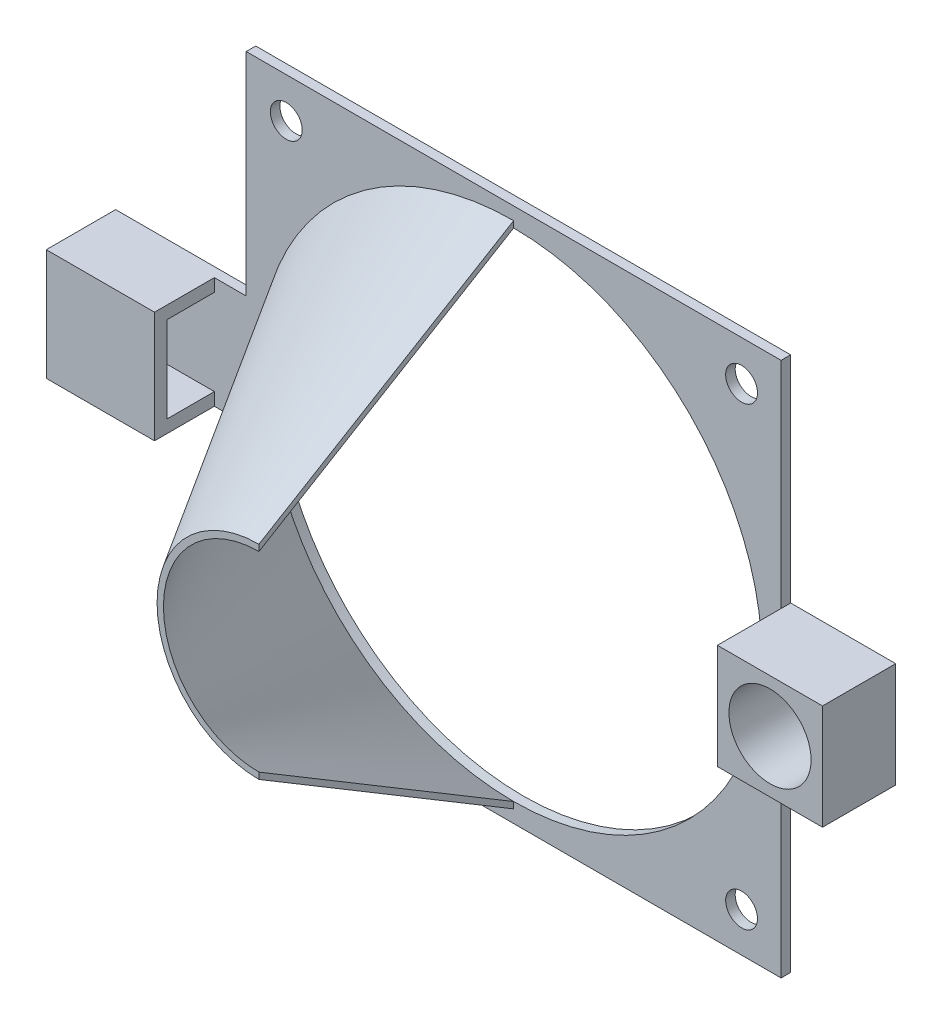
ISO-10303-21;
HEADER;
FILE_DESCRIPTION(('STEP AP214'),'2;1');
FILE_NAME('part.step','',(''),(''),'','','');
FILE_SCHEMA(('AUTOMOTIVE_DESIGN { 1 0 10303 214 1 1 1 1 }'));
ENDSEC;
DATA;
#1=APPLICATION_CONTEXT('core data for automotive mechanical design processes');
#2=APPLICATION_PROTOCOL_DEFINITION('international standard','automotive_design',2000,#1);
#3=PRODUCT_CONTEXT('',#1,'mechanical');
#4=PRODUCT('Part','Part','',(#3));
#5=PRODUCT_RELATED_PRODUCT_CATEGORY('part','',(#4));
#6=PRODUCT_DEFINITION_FORMATION('','',#4);
#7=PRODUCT_DEFINITION_CONTEXT('part definition',#1,'design');
#8=PRODUCT_DEFINITION('design','',#6,#7);
#9=PRODUCT_DEFINITION_SHAPE('','',#8);
#10=(LENGTH_UNIT() NAMED_UNIT(*) SI_UNIT(.MILLI.,.METRE.));
#11=(NAMED_UNIT(*) PLANE_ANGLE_UNIT() SI_UNIT($,.RADIAN.));
#12=(NAMED_UNIT(*) SI_UNIT($,.STERADIAN.) SOLID_ANGLE_UNIT());
#13=UNCERTAINTY_MEASURE_WITH_UNIT(LENGTH_MEASURE(1.E-05),#10,'distance_accuracy_value','');
#14=(GEOMETRIC_REPRESENTATION_CONTEXT(3) GLOBAL_UNCERTAINTY_ASSIGNED_CONTEXT((#13)) GLOBAL_UNIT_ASSIGNED_CONTEXT((#10,
#11,#12)) REPRESENTATION_CONTEXT('',''));
#15=CARTESIAN_POINT('',(0.,0.,0.));
#16=DIRECTION('',(0.,0.,1.));
#17=DIRECTION('',(1.,0.,0.));
#18=AXIS2_PLACEMENT_3D('',#15,#16,#17);
#19=CARTESIAN_POINT('',(-19.3198380566802,34.4939271255061,1.5));
#20=DIRECTION('',(-1.,0.,0.));
#21=DIRECTION('',(0.,-1.,0.));
#22=AXIS2_PLACEMENT_3D('',#19,#20,#21);
#23=PLANE('',#22);
#24=DIRECTION('',(0.,0.,-1.));
#25=VECTOR('',#24,1.);
#26=CARTESIAN_POINT('',(-19.3198380566801,-15.7560728744939,1.5));
#27=LINE('',#26,#25);
#28=CARTESIAN_POINT('',(-19.3198380566801,-15.7560728744939,1.5));
#29=VERTEX_POINT('',#28);
#30=CARTESIAN_POINT('',(-19.3198380566801,-15.7560728744939,0.));
#31=VERTEX_POINT('',#30);
#32=EDGE_CURVE('E226',#29,#31,#27,.T.);
#33=ORIENTED_EDGE('',*,*,#32,.F.);
#34=DIRECTION('',(0.,1.,0.));
#35=VECTOR('',#34,1.);
#36=CARTESIAN_POINT('',(-19.3198380566802,34.4939271255061,1.5));
#37=LINE('',#36,#35);
#38=CARTESIAN_POINT('',(-19.3198380566801,-49.5060728744939,1.5));
#39=VERTEX_POINT('',#38);
#40=EDGE_CURVE('E445',#39,#29,#37,.T.);
#41=ORIENTED_EDGE('',*,*,#40,.F.);
#42=DIRECTION('',(0.,0.,-1.));
#43=VECTOR('',#42,1.);
#44=CARTESIAN_POINT('',(-19.3198380566801,-49.5060728744939,1.5));
#45=LINE('',#44,#43);
#46=CARTESIAN_POINT('',(-19.3198380566801,-49.5060728744939,0.));
#47=VERTEX_POINT('',#46);
#48=EDGE_CURVE('E359',#39,#47,#45,.T.);
#49=ORIENTED_EDGE('',*,*,#48,.T.);
#50=DIRECTION('',(0.,1.,0.));
#51=VECTOR('',#50,1.);
#52=CARTESIAN_POINT('',(-19.3198380566802,34.4939271255061,0.));
#53=LINE('',#52,#51);
#54=EDGE_CURVE('E60',#47,#31,#53,.T.);
#55=ORIENTED_EDGE('',*,*,#54,.T.);
#56=EDGE_LOOP('',(#33,#41,#49,#55));
#57=FACE_BOUND('',#56,.T.);
#58=ADVANCED_FACE('F35',(#57),#23,.F.);
#59=DIRECTION('',(0.,0.,1.));
#60=VECTOR('',#59,1.);
#61=CARTESIAN_POINT('',(-19.3198380566801,0.743927125506059,0.));
#62=LINE('',#61,#60);
#63=CARTESIAN_POINT('',(-19.3198380566801,0.74392712550609,0.));
#64=VERTEX_POINT('',#63);
#65=CARTESIAN_POINT('',(-19.3198380566801,0.743927125506055,1.5));
#66=VERTEX_POINT('',#65);
#67=EDGE_CURVE('E52',#64,#66,#62,.T.);
#68=ORIENTED_EDGE('',*,*,#67,.F.);
#69=CARTESIAN_POINT('',(-19.3198380566802,34.4939271255061,0.));
#70=VERTEX_POINT('',#69);
#71=EDGE_CURVE('E343',#64,#70,#53,.T.);
#72=ORIENTED_EDGE('',*,*,#71,.T.);
#73=DIRECTION('',(0.,0.,-1.));
#74=VECTOR('',#73,1.);
#75=CARTESIAN_POINT('',(-19.3198380566802,34.4939271255061,1.5));
#76=LINE('',#75,#74);
#77=CARTESIAN_POINT('',(-19.3198380566802,34.4939271255061,1.5));
#78=VERTEX_POINT('',#77);
#79=EDGE_CURVE('E355',#78,#70,#76,.T.);
#80=ORIENTED_EDGE('',*,*,#79,.F.);
#81=EDGE_CURVE('E449',#66,#78,#37,.T.);
#82=ORIENTED_EDGE('',*,*,#81,.F.);
#83=EDGE_LOOP('',(#68,#72,#80,#82));
#84=FACE_BOUND('',#83,.T.);
#85=ADVANCED_FACE('F494',(#84),#23,.F.);
#86=CARTESIAN_POINT('',(-123.31983805668,0.,0.));
#87=DIRECTION('',(-1.,0.,0.));
#88=DIRECTION('',(0.,0.,1.));
#89=AXIS2_PLACEMENT_3D('',#86,#87,#88);
#90=PLANE('',#89);
#91=DIRECTION('',(0.,-1.,0.));
#92=VECTOR('',#91,1.);
#93=CARTESIAN_POINT('',(-123.31983805668,0.,8.9));
#94=LINE('',#93,#92);
#95=CARTESIAN_POINT('',(-123.31983805668,-6.47772468443378,8.9));
#96=VERTEX_POINT('',#95);
#97=CARTESIAN_POINT('',(-123.31983805668,-8.53442106455411,8.9));
#98=VERTEX_POINT('',#97);
#99=EDGE_CURVE('E295',#96,#98,#94,.T.);
#100=ORIENTED_EDGE('',*,*,#99,.T.);
#101=CARTESIAN_POINT('',(-123.31983805668,-7.50607287449394,5.45));
#102=DIRECTION('',(-1.,0.,0.));
#103=DIRECTION('',(0.,0.,1.));
#104=AXIS2_PLACEMENT_3D('',#101,#102,#103);
#105=CIRCLE('',#104,3.6);
#106=EDGE_CURVE('E44',#98,#96,#105,.T.);
#107=ORIENTED_EDGE('',*,*,#106,.T.);
#108=EDGE_LOOP('',(#100,#107));
#109=FACE_BOUND('',#108,.T.);
#110=ADVANCED_FACE('F499',(#109),#90,.T.);
#111=CARTESIAN_POINT('',(0.,0.,1.5));
#112=DIRECTION('',(0.,0.,1.));
#113=DIRECTION('',(1.,0.,0.));
#114=AXIS2_PLACEMENT_3D('',#111,#112,#113);
#115=PLANE('',#114);
#116=ORIENTED_EDGE('',*,*,#40,.T.);
#117=DIRECTION('',(0.,-1.,0.));
#118=VECTOR('',#117,1.);
#119=CARTESIAN_POINT('',(-19.3198380566801,-15.7560728744939,1.5));
#120=LINE('',#119,#118);
#121=EDGE_CURVE('E221',#66,#29,#120,.T.);
#122=ORIENTED_EDGE('',*,*,#121,.F.);
#123=ORIENTED_EDGE('',*,*,#81,.T.);
#124=DIRECTION('',(-1.,0.,0.));
#125=VECTOR('',#124,1.);
#126=CARTESIAN_POINT('',(-103.31983805668,34.4939271255061,1.5));
#127=LINE('',#126,#125);
#128=CARTESIAN_POINT('',(-103.31983805668,34.4939271255061,1.5));
#129=VERTEX_POINT('',#128);
#130=EDGE_CURVE('E356',#78,#129,#127,.T.);
#131=ORIENTED_EDGE('',*,*,#130,.T.);
#132=DIRECTION('',(0.,-1.,0.));
#133=VECTOR('',#132,1.);
#134=CARTESIAN_POINT('',(-103.31983805668,34.4939271255061,1.5));
#135=LINE('',#134,#133);
#136=CARTESIAN_POINT('',(-103.31983805668,1.2439271255061,1.5));
#137=VERTEX_POINT('',#136);
#138=EDGE_CURVE('E436',#129,#137,#135,.T.);
#139=ORIENTED_EDGE('',*,*,#138,.T.);
#140=DIRECTION('',(1.,0.,0.));
#141=VECTOR('',#140,1.);
#142=CARTESIAN_POINT('',(-123.31983805668,1.24392712550606,1.5));
#143=LINE('',#142,#141);
#144=CARTESIAN_POINT('',(-108.31983805668,1.24392712550606,1.5));
#145=VERTEX_POINT('',#144);
#146=EDGE_CURVE('E338',#145,#137,#143,.T.);
#147=ORIENTED_EDGE('',*,*,#146,.F.);
#148=DIRECTION('',(0.,1.,0.));
#149=VECTOR('',#148,1.);
#150=CARTESIAN_POINT('',(-108.31983805668,0.,1.5));
#151=LINE('',#150,#149);
#152=CARTESIAN_POINT('',(-108.31983805668,-0.756072874493947,1.5));
#153=VERTEX_POINT('',#152);
#154=EDGE_CURVE('E283',#153,#145,#151,.T.);
#155=ORIENTED_EDGE('',*,*,#154,.F.);
#156=DIRECTION('',(-1.,0.,0.));
#157=VECTOR('',#156,1.);
#158=CARTESIAN_POINT('',(-108.31983805668,-0.756072874493947,1.5));
#159=LINE('',#158,#157);
#160=CARTESIAN_POINT('',(-123.31983805668,-0.756072874493947,1.5));
#161=VERTEX_POINT('',#160);
#162=EDGE_CURVE('E298',#153,#161,#159,.T.);
#163=ORIENTED_EDGE('',*,*,#162,.T.);
#164=DIRECTION('',(0.,1.,0.));
#165=VECTOR('',#164,1.);
#166=CARTESIAN_POINT('',(-123.31983805668,-16.2560728744939,1.5));
#167=LINE('',#166,#165);
#168=CARTESIAN_POINT('',(-123.31983805668,-14.2560728744939,1.5));
#169=VERTEX_POINT('',#168);
#170=EDGE_CURVE('E315',#169,#161,#167,.T.);
#171=ORIENTED_EDGE('',*,*,#170,.F.);
#172=DIRECTION('',(-1.,0.,0.));
#173=VECTOR('',#172,1.);
#174=CARTESIAN_POINT('',(-108.31983805668,-14.2560728744939,1.5));
#175=LINE('',#174,#173);
#176=CARTESIAN_POINT('',(-108.31983805668,-14.2560728744939,1.5));
#177=VERTEX_POINT('',#176);
#178=EDGE_CURVE('E306',#177,#169,#175,.T.);
#179=ORIENTED_EDGE('',*,*,#178,.F.);
#180=CARTESIAN_POINT('',(-108.31983805668,-16.2560728744939,1.5));
#181=VERTEX_POINT('',#180);
#182=EDGE_CURVE('E280',#181,#177,#151,.T.);
#183=ORIENTED_EDGE('',*,*,#182,.F.);
#184=DIRECTION('',(1.,0.,0.));
#185=VECTOR('',#184,1.);
#186=CARTESIAN_POINT('',(-123.31983805668,-16.2560728744939,1.5));
#187=LINE('',#186,#185);
#188=CARTESIAN_POINT('',(-103.31983805668,-16.2560728744939,1.5));
#189=VERTEX_POINT('',#188);
#190=EDGE_CURVE('E335',#181,#189,#187,.T.);
#191=ORIENTED_EDGE('',*,*,#190,.T.);
#192=CARTESIAN_POINT('',(-103.31983805668,-49.5060728744939,1.5));
#193=VERTEX_POINT('',#192);
#194=EDGE_CURVE('E327',#189,#193,#135,.T.);
#195=ORIENTED_EDGE('',*,*,#194,.T.);
#196=DIRECTION('',(1.,0.,0.));
#197=VECTOR('',#196,1.);
#198=CARTESIAN_POINT('',(-103.31983805668,-49.5060728744939,1.5));
#199=LINE('',#198,#197);
#200=EDGE_CURVE('E433',#193,#39,#199,.T.);
#201=ORIENTED_EDGE('',*,*,#200,.T.);
#202=EDGE_LOOP('',(#116,#122,#123,#131,#139,#147,#155,#163,#171,#179,#183,#191,#195,#201));
#203=FACE_BOUND('',#202,.T.);
#204=CARTESIAN_POINT('',(-25.5287305066001,-43.2971804245733,1.5));
#205=DIRECTION('',(0.,0.,1.));
#206=DIRECTION('',(1.,0.,0.));
#207=AXIS2_PLACEMENT_3D('',#204,#205,#206);
#208=CIRCLE('',#207,2.50000000000001);
#209=CARTESIAN_POINT('',(-23.0287305066001,-43.2971804245733,1.5));
#210=VERTEX_POINT('',#209);
#211=EDGE_CURVE('E413',#210,#210,#208,.T.);
#212=ORIENTED_EDGE('',*,*,#211,.F.);
#213=EDGE_LOOP('',(#212));
#214=FACE_BOUND('',#213,.T.);
#215=CARTESIAN_POINT('',(-97.0287305066008,28.2028195754267,1.5));
#216=DIRECTION('',(0.,0.,1.));
#217=DIRECTION('',(1.,0.,0.));
#218=AXIS2_PLACEMENT_3D('',#215,#216,#217);
#219=CIRCLE('',#218,2.50000000000001);
#220=CARTESIAN_POINT('',(-94.5287305066008,28.2028195754267,1.5));
#221=VERTEX_POINT('',#220);
#222=EDGE_CURVE('E425',#221,#221,#219,.T.);
#223=ORIENTED_EDGE('',*,*,#222,.F.);
#224=EDGE_LOOP('',(#223));
#225=FACE_BOUND('',#224,.T.);
#226=CARTESIAN_POINT('',(-25.5287305066008,28.2028195754267,1.5));
#227=DIRECTION('',(0.,0.,1.));
#228=DIRECTION('',(1.,0.,0.));
#229=AXIS2_PLACEMENT_3D('',#226,#227,#228);
#230=CIRCLE('',#229,2.50000000000001);
#231=CARTESIAN_POINT('',(-23.0287305066008,28.2028195754267,1.5));
#232=VERTEX_POINT('',#231);
#233=EDGE_CURVE('E419',#232,#232,#230,.T.);
#234=ORIENTED_EDGE('',*,*,#233,.F.);
#235=EDGE_LOOP('',(#234));
#236=FACE_BOUND('',#235,.T.);
#237=CARTESIAN_POINT('',(-97.0287305066001,-43.2971804245733,1.5));
#238=DIRECTION('',(0.,0.,1.));
#239=DIRECTION('',(1.,0.,0.));
#240=AXIS2_PLACEMENT_3D('',#237,#238,#239);
#241=CIRCLE('',#240,2.50000000000001);
#242=CARTESIAN_POINT('',(-94.5287305066,-43.2971804245733,1.5));
#243=VERTEX_POINT('',#242);
#244=EDGE_CURVE('E407',#243,#243,#241,.T.);
#245=ORIENTED_EDGE('',*,*,#244,.F.);
#246=EDGE_LOOP('',(#245));
#247=FACE_BOUND('',#246,.T.);
#248=CARTESIAN_POINT('',(-61.3198380566801,-7.50607287449393,1.50000000000001));
#249=DIRECTION('',(0.,0.,1.));
#250=DIRECTION('',(0.,-1.,0.));
#251=AXIS2_PLACEMENT_3D('',#248,#249,#250);
#252=CIRCLE('',#251,40.);
#253=CARTESIAN_POINT('',(-61.3198380566799,32.4939271255061,1.50000000000001));
#254=VERTEX_POINT('',#253);
#255=CARTESIAN_POINT('',(-61.3198380566801,-47.5060728744939,1.5));
#256=VERTEX_POINT('',#255);
#257=EDGE_CURVE('E403',#254,#256,#252,.T.);
#258=ORIENTED_EDGE('',*,*,#257,.F.);
#259=DIRECTION('',(0.,-1.,0.));
#260=VECTOR('',#259,1.);
#261=CARTESIAN_POINT('',(-61.3198380566799,31.4939271255061,1.50000000000001));
#262=LINE('',#261,#260);
#263=CARTESIAN_POINT('',(-61.3198380566799,31.4939271255061,1.5));
#264=VERTEX_POINT('',#263);
#265=EDGE_CURVE('E383',#254,#264,#262,.T.);
#266=ORIENTED_EDGE('',*,*,#265,.T.);
#267=CARTESIAN_POINT('',(-61.3198380566801,-7.50607287449393,1.5));
#268=DIRECTION('',(0.,0.,1.));
#269=DIRECTION('',(1.,0.,0.));
#270=AXIS2_PLACEMENT_3D('',#267,#268,#269);
#271=CIRCLE('',#270,39.);
#272=CARTESIAN_POINT('',(-61.3198380566801,-46.5060728744939,1.5));
#273=VERTEX_POINT('',#272);
#274=EDGE_CURVE('E367',#273,#264,#271,.T.);
#275=ORIENTED_EDGE('',*,*,#274,.F.);
#276=DIRECTION('',(0.,1.,0.));
#277=VECTOR('',#276,1.);
#278=CARTESIAN_POINT('',(-61.3198380566801,-46.5060728744939,1.5));
#279=LINE('',#278,#277);
#280=EDGE_CURVE('E378',#256,#273,#279,.T.);
#281=ORIENTED_EDGE('',*,*,#280,.F.);
#282=EDGE_LOOP('',(#258,#266,#275,#281));
#283=FACE_BOUND('',#282,.T.);
#284=ADVANCED_FACE('F456',(#203,#214,#225,#236,#247,#283),#115,.T.);
#285=CARTESIAN_POINT('',(-103.31983805668,34.4939271255061,1.5));
#286=DIRECTION('',(1.,0.,0.));
#287=DIRECTION('',(0.,1.,0.));
#288=AXIS2_PLACEMENT_3D('',#285,#286,#287);
#289=PLANE('',#288);
#290=DIRECTION('',(0.,0.,-1.));
#291=VECTOR('',#290,1.);
#292=CARTESIAN_POINT('',(-103.31983805668,1.24392712550606,1.5));
#293=LINE('',#292,#291);
#294=CARTESIAN_POINT('',(-103.31983805668,1.2439271255061,0.));
#295=VERTEX_POINT('',#294);
#296=EDGE_CURVE('E318',#137,#295,#293,.T.);
#297=ORIENTED_EDGE('',*,*,#296,.F.);
#298=ORIENTED_EDGE('',*,*,#138,.F.);
#299=DIRECTION('',(0.,0.,-1.));
#300=VECTOR('',#299,1.);
#301=CARTESIAN_POINT('',(-103.31983805668,34.4939271255061,1.5));
#302=LINE('',#301,#300);
#303=CARTESIAN_POINT('',(-103.31983805668,34.4939271255061,0.));
#304=VERTEX_POINT('',#303);
#305=EDGE_CURVE('E352',#129,#304,#302,.T.);
#306=ORIENTED_EDGE('',*,*,#305,.T.);
#307=DIRECTION('',(0.,-1.,0.));
#308=VECTOR('',#307,1.);
#309=CARTESIAN_POINT('',(-103.31983805668,34.4939271255061,0.));
#310=LINE('',#309,#308);
#311=EDGE_CURVE('E440',#304,#295,#310,.T.);
#312=ORIENTED_EDGE('',*,*,#311,.T.);
#313=EDGE_LOOP('',(#297,#298,#306,#312));
#314=FACE_BOUND('',#313,.T.);
#315=ADVANCED_FACE('F37',(#314),#289,.F.);
#316=DIRECTION('',(0.,0.,1.));
#317=VECTOR('',#316,1.);
#318=CARTESIAN_POINT('',(-103.31983805668,-16.2560728744939,0.));
#319=LINE('',#318,#317);
#320=CARTESIAN_POINT('',(-103.31983805668,-16.2560728744939,0.));
#321=VERTEX_POINT('',#320);
#322=EDGE_CURVE('E301',#321,#189,#319,.T.);
#323=ORIENTED_EDGE('',*,*,#322,.F.);
#324=CARTESIAN_POINT('',(-103.31983805668,-49.5060728744939,0.));
#325=VERTEX_POINT('',#324);
#326=EDGE_CURVE('E366',#321,#325,#310,.T.);
#327=ORIENTED_EDGE('',*,*,#326,.T.);
#328=DIRECTION('',(0.,0.,-1.));
#329=VECTOR('',#328,1.);
#330=CARTESIAN_POINT('',(-103.31983805668,-49.5060728744939,1.5));
#331=LINE('',#330,#329);
#332=EDGE_CURVE('E361',#193,#325,#331,.T.);
#333=ORIENTED_EDGE('',*,*,#332,.F.);
#334=ORIENTED_EDGE('',*,*,#194,.F.);
#335=EDGE_LOOP('',(#323,#327,#333,#334));
#336=FACE_BOUND('',#335,.T.);
#337=ADVANCED_FACE('F510',(#336),#289,.F.);
#338=CARTESIAN_POINT('',(0.,0.,0.));
#339=DIRECTION('',(0.,0.,1.));
#340=DIRECTION('',(1.,0.,0.));
#341=AXIS2_PLACEMENT_3D('',#338,#339,#340);
#342=PLANE('',#341);
#343=ORIENTED_EDGE('',*,*,#311,.F.);
#344=DIRECTION('',(-1.,0.,0.));
#345=VECTOR('',#344,1.);
#346=CARTESIAN_POINT('',(-103.31983805668,34.4939271255061,0.));
#347=LINE('',#346,#345);
#348=EDGE_CURVE('E342',#70,#304,#347,.T.);
#349=ORIENTED_EDGE('',*,*,#348,.F.);
#350=ORIENTED_EDGE('',*,*,#71,.F.);
#351=DIRECTION('',(-1.,0.,0.));
#352=VECTOR('',#351,1.);
#353=CARTESIAN_POINT('',(-2.81983805668014,0.743927125506062,0.));
#354=LINE('',#353,#352);
#355=CARTESIAN_POINT('',(-2.81983805668014,0.743927125506062,0.));
#356=VERTEX_POINT('',#355);
#357=EDGE_CURVE('E241',#356,#64,#354,.T.);
#358=ORIENTED_EDGE('',*,*,#357,.F.);
#359=DIRECTION('',(0.,1.,0.));
#360=VECTOR('',#359,1.);
#361=CARTESIAN_POINT('',(-2.81983805668014,-15.756072874494,0.));
#362=LINE('',#361,#360);
#363=CARTESIAN_POINT('',(-2.81983805668014,-15.756072874494,0.));
#364=VERTEX_POINT('',#363);
#365=EDGE_CURVE('E244',#364,#356,#362,.T.);
#366=ORIENTED_EDGE('',*,*,#365,.F.);
#367=DIRECTION('',(-1.,0.,0.));
#368=VECTOR('',#367,1.);
#369=CARTESIAN_POINT('',(-2.81983805668014,-15.756072874494,0.));
#370=LINE('',#369,#368);
#371=EDGE_CURVE('E238',#364,#31,#370,.T.);
#372=ORIENTED_EDGE('',*,*,#371,.T.);
#373=ORIENTED_EDGE('',*,*,#54,.F.);
#374=DIRECTION('',(1.,0.,0.));
#375=VECTOR('',#374,1.);
#376=CARTESIAN_POINT('',(-103.31983805668,-49.5060728744939,0.));
#377=LINE('',#376,#375);
#378=EDGE_CURVE('E348',#325,#47,#377,.T.);
#379=ORIENTED_EDGE('',*,*,#378,.F.);
#380=ORIENTED_EDGE('',*,*,#326,.F.);
#381=DIRECTION('',(1.,0.,0.));
#382=VECTOR('',#381,1.);
#383=CARTESIAN_POINT('',(-123.31983805668,-16.2560728744939,0.));
#384=LINE('',#383,#382);
#385=CARTESIAN_POINT('',(-125.31983805668,-16.2560728744939,0.));
#386=VERTEX_POINT('',#385);
#387=EDGE_CURVE('E332',#386,#321,#384,.T.);
#388=ORIENTED_EDGE('',*,*,#387,.F.);
#389=DIRECTION('',(0.,-1.,0.));
#390=VECTOR('',#389,1.);
#391=CARTESIAN_POINT('',(-125.31983805668,1.24392712550606,0.));
#392=LINE('',#391,#390);
#393=CARTESIAN_POINT('',(-125.31983805668,1.24392712550606,0.));
#394=VERTEX_POINT('',#393);
#395=EDGE_CURVE('E255',#394,#386,#392,.T.);
#396=ORIENTED_EDGE('',*,*,#395,.F.);
#397=DIRECTION('',(1.,0.,0.));
#398=VECTOR('',#397,1.);
#399=CARTESIAN_POINT('',(-123.31983805668,1.24392712550606,0.));
#400=LINE('',#399,#398);
#401=EDGE_CURVE('E317',#394,#295,#400,.T.);
#402=ORIENTED_EDGE('',*,*,#401,.T.);
#403=EDGE_LOOP('',(#343,#349,#350,#358,#366,#372,#373,#379,#380,#388,#396,#402));
#404=FACE_BOUND('',#403,.T.);
#405=CARTESIAN_POINT('',(-61.3198380566801,-7.50607287449393,0.));
#406=DIRECTION('',(0.,0.,1.));
#407=DIRECTION('',(1.,0.,0.));
#408=AXIS2_PLACEMENT_3D('',#405,#406,#407);
#409=CIRCLE('',#408,39.);
#410=CARTESIAN_POINT('',(-22.3198380566801,-7.50607287449393,0.));
#411=VERTEX_POINT('',#410);
#412=EDGE_CURVE('E373',#411,#411,#409,.T.);
#413=ORIENTED_EDGE('',*,*,#412,.T.);
#414=EDGE_LOOP('',(#413));
#415=FACE_BOUND('',#414,.T.);
#416=CARTESIAN_POINT('',(-97.0287305066008,28.2028195754267,0.));
#417=DIRECTION('',(0.,0.,1.));
#418=DIRECTION('',(1.,0.,0.));
#419=AXIS2_PLACEMENT_3D('',#416,#417,#418);
#420=CIRCLE('',#419,2.50000000000001);
#421=CARTESIAN_POINT('',(-94.5287305066008,28.2028195754267,0.));
#422=VERTEX_POINT('',#421);
#423=EDGE_CURVE('E422',#422,#422,#420,.T.);
#424=ORIENTED_EDGE('',*,*,#423,.T.);
#425=EDGE_LOOP('',(#424));
#426=FACE_BOUND('',#425,.T.);
#427=CARTESIAN_POINT('',(-25.5287305066008,28.2028195754267,0.));
#428=DIRECTION('',(0.,0.,1.));
#429=DIRECTION('',(1.,0.,0.));
#430=AXIS2_PLACEMENT_3D('',#427,#428,#429);
#431=CIRCLE('',#430,2.50000000000001);
#432=CARTESIAN_POINT('',(-23.0287305066008,28.2028195754267,0.));
#433=VERTEX_POINT('',#432);
#434=EDGE_CURVE('E416',#433,#433,#431,.T.);
#435=ORIENTED_EDGE('',*,*,#434,.T.);
#436=EDGE_LOOP('',(#435));
#437=FACE_BOUND('',#436,.T.);
#438=CARTESIAN_POINT('',(-25.5287305066001,-43.2971804245733,0.));
#439=DIRECTION('',(0.,0.,1.));
#440=DIRECTION('',(1.,0.,0.));
#441=AXIS2_PLACEMENT_3D('',#438,#439,#440);
#442=CIRCLE('',#441,2.50000000000001);
#443=CARTESIAN_POINT('',(-23.0287305066001,-43.2971804245733,0.));
#444=VERTEX_POINT('',#443);
#445=EDGE_CURVE('E410',#444,#444,#442,.T.);
#446=ORIENTED_EDGE('',*,*,#445,.T.);
#447=EDGE_LOOP('',(#446));
#448=FACE_BOUND('',#447,.T.);
#449=CARTESIAN_POINT('',(-97.0287305066001,-43.2971804245733,0.));
#450=DIRECTION('',(0.,0.,1.));
#451=DIRECTION('',(1.,0.,0.));
#452=AXIS2_PLACEMENT_3D('',#449,#450,#451);
#453=CIRCLE('',#452,2.50000000000001);
#454=CARTESIAN_POINT('',(-94.5287305066,-43.2971804245733,0.));
#455=VERTEX_POINT('',#454);
#456=EDGE_CURVE('E406',#455,#455,#453,.T.);
#457=ORIENTED_EDGE('',*,*,#456,.T.);
#458=EDGE_LOOP('',(#457));
#459=FACE_BOUND('',#458,.T.);
#460=ADVANCED_FACE('F466',(#404,#415,#426,#437,#448,#459),#342,.F.);
#461=CARTESIAN_POINT('',(-103.31983805668,-49.5060728744939,1.5));
#462=DIRECTION('',(0.,1.,0.));
#463=DIRECTION('',(0.,0.,1.));
#464=AXIS2_PLACEMENT_3D('',#461,#462,#463);
#465=PLANE('',#464);
#466=ORIENTED_EDGE('',*,*,#378,.T.);
#467=ORIENTED_EDGE('',*,*,#48,.F.);
#468=ORIENTED_EDGE('',*,*,#200,.F.);
#469=ORIENTED_EDGE('',*,*,#332,.T.);
#470=EDGE_LOOP('',(#466,#467,#468,#469));
#471=FACE_BOUND('',#470,.T.);
#472=ADVANCED_FACE('F461',(#471),#465,.F.);
#473=CARTESIAN_POINT('',(-103.31983805668,34.4939271255061,1.5));
#474=DIRECTION('',(0.,-1.,0.));
#475=DIRECTION('',(0.,0.,-1.));
#476=AXIS2_PLACEMENT_3D('',#473,#474,#475);
#477=PLANE('',#476);
#478=ORIENTED_EDGE('',*,*,#348,.T.);
#479=ORIENTED_EDGE('',*,*,#305,.F.);
#480=ORIENTED_EDGE('',*,*,#130,.F.);
#481=ORIENTED_EDGE('',*,*,#79,.T.);
#482=EDGE_LOOP('',(#478,#479,#480,#481));
#483=FACE_BOUND('',#482,.T.);
#484=ADVANCED_FACE('F501',(#483),#477,.F.);
#485=CARTESIAN_POINT('',(-61.3198380566801,-7.50607287449393,1.5));
#486=DIRECTION('',(0.,0.,-1.));
#487=DIRECTION('',(-1.,0.,0.));
#488=AXIS2_PLACEMENT_3D('',#485,#486,#487);
#489=CYLINDRICAL_SURFACE('',#488,39.);
#490=EDGE_CURVE('E364',#264,#273,#271,.T.);
#491=ORIENTED_EDGE('',*,*,#490,.T.);
#492=ORIENTED_EDGE('',*,*,#274,.T.);
#493=EDGE_LOOP('',(#491,#492));
#494=FACE_BOUND('',#493,.T.);
#495=ORIENTED_EDGE('',*,*,#412,.F.);
#496=EDGE_LOOP('',(#495));
#497=FACE_BOUND('',#496,.T.);
#498=ADVANCED_FACE('F508',(#494,#497),#489,.F.);
#499=CARTESIAN_POINT('',(-97.0287305066008,28.2028195754267,1.5));
#500=DIRECTION('',(0.,0.,-1.));
#501=DIRECTION('',(-1.,0.,0.));
#502=AXIS2_PLACEMENT_3D('',#499,#500,#501);
#503=CYLINDRICAL_SURFACE('',#502,2.50000000000001);
#504=ORIENTED_EDGE('',*,*,#222,.T.);
#505=EDGE_LOOP('',(#504));
#506=FACE_BOUND('',#505,.T.);
#507=ORIENTED_EDGE('',*,*,#423,.F.);
#508=EDGE_LOOP('',(#507));
#509=FACE_BOUND('',#508,.T.);
#510=ADVANCED_FACE('F521',(#506,#509),#503,.F.);
#511=CARTESIAN_POINT('',(-25.5287305066008,28.2028195754267,1.5));
#512=DIRECTION('',(0.,0.,-1.));
#513=DIRECTION('',(-1.,0.,0.));
#514=AXIS2_PLACEMENT_3D('',#511,#512,#513);
#515=CYLINDRICAL_SURFACE('',#514,2.50000000000001);
#516=ORIENTED_EDGE('',*,*,#233,.T.);
#517=EDGE_LOOP('',(#516));
#518=FACE_BOUND('',#517,.T.);
#519=ORIENTED_EDGE('',*,*,#434,.F.);
#520=EDGE_LOOP('',(#519));
#521=FACE_BOUND('',#520,.T.);
#522=ADVANCED_FACE('F525',(#518,#521),#515,.F.);
#523=CARTESIAN_POINT('',(-25.5287305066001,-43.2971804245733,1.5));
#524=DIRECTION('',(0.,0.,-1.));
#525=DIRECTION('',(-1.,0.,0.));
#526=AXIS2_PLACEMENT_3D('',#523,#524,#525);
#527=CYLINDRICAL_SURFACE('',#526,2.50000000000001);
#528=ORIENTED_EDGE('',*,*,#211,.T.);
#529=EDGE_LOOP('',(#528));
#530=FACE_BOUND('',#529,.T.);
#531=ORIENTED_EDGE('',*,*,#445,.F.);
#532=EDGE_LOOP('',(#531));
#533=FACE_BOUND('',#532,.T.);
#534=ADVANCED_FACE('F529',(#530,#533),#527,.F.);
#535=CARTESIAN_POINT('',(-97.0287305066001,-43.2971804245733,1.5));
#536=DIRECTION('',(0.,0.,-1.));
#537=DIRECTION('',(-1.,0.,0.));
#538=AXIS2_PLACEMENT_3D('',#535,#536,#537);
#539=CYLINDRICAL_SURFACE('',#538,2.50000000000001);
#540=ORIENTED_EDGE('',*,*,#244,.T.);
#541=EDGE_LOOP('',(#540));
#542=FACE_BOUND('',#541,.T.);
#543=ORIENTED_EDGE('',*,*,#456,.F.);
#544=EDGE_LOOP('',(#543));
#545=FACE_BOUND('',#544,.T.);
#546=ADVANCED_FACE('F533',(#542,#545),#539,.F.);
#547=CARTESIAN_POINT('',(-61.3198380566801,-7.50607287449394,41.5));
#548=DIRECTION('',(0.,0.,-1.));
#549=DIRECTION('',(0.,1.,0.));
#550=AXIS2_PLACEMENT_3D('',#547,#548,#549);
#551=CONICAL_SURFACE('',#550,16.,0.540419500270584);
#552=CARTESIAN_POINT('',(-61.3198380566801,-7.50607287449394,41.5));
#553=DIRECTION('',(0.,0.,1.));
#554=DIRECTION('',(0.,-1.,0.));
#555=AXIS2_PLACEMENT_3D('',#552,#553,#554);
#556=CIRCLE('',#555,16.);
#557=CARTESIAN_POINT('',(-61.31983805668,8.49392712550607,41.5));
#558=VERTEX_POINT('',#557);
#559=CARTESIAN_POINT('',(-61.3198380566801,-23.5060728744939,41.5));
#560=VERTEX_POINT('',#559);
#561=EDGE_CURVE('E401',#558,#560,#556,.T.);
#562=ORIENTED_EDGE('',*,*,#561,.F.);
#563=DIRECTION('',(0.,0.514495755427527,-0.857492925712544));
#564=VECTOR('',#563,1.);
#565=CARTESIAN_POINT('',(-61.3198380566799,32.4939271255061,1.50000000000001));
#566=LINE('',#565,#564);
#567=EDGE_CURVE('E395',#558,#254,#566,.T.);
#568=ORIENTED_EDGE('',*,*,#567,.T.);
#569=ORIENTED_EDGE('',*,*,#257,.T.);
#570=DIRECTION('',(0.,-0.514495755427526,-0.857492925712544));
#571=VECTOR('',#570,1.);
#572=CARTESIAN_POINT('',(-61.3198380566801,-47.5060728744939,1.5));
#573=LINE('',#572,#571);
#574=EDGE_CURVE('E389',#560,#256,#573,.T.);
#575=ORIENTED_EDGE('',*,*,#574,.F.);
#576=EDGE_LOOP('',(#562,#568,#569,#575));
#577=FACE_BOUND('',#576,.T.);
#578=ADVANCED_FACE('F537',(#577),#551,.T.);
#579=CARTESIAN_POINT('',(-61.31983805668,8.49392712550607,41.5));
#580=DIRECTION('',(0.,0.,1.));
#581=DIRECTION('',(0.,-1.,0.));
#582=AXIS2_PLACEMENT_3D('',#579,#580,#581);
#583=PLANE('',#582);
#584=CARTESIAN_POINT('',(-61.3198380566801,-7.50607287449394,41.5));
#585=DIRECTION('',(0.,0.,1.));
#586=DIRECTION('',(0.,-1.,0.));
#587=AXIS2_PLACEMENT_3D('',#584,#585,#586);
#588=CIRCLE('',#587,15.);
#589=CARTESIAN_POINT('',(-61.31983805668,7.49392712550606,41.5));
#590=VERTEX_POINT('',#589);
#591=CARTESIAN_POINT('',(-61.3198380566801,-22.5060728744939,41.5));
#592=VERTEX_POINT('',#591);
#593=EDGE_CURVE('E399',#590,#592,#588,.T.);
#594=ORIENTED_EDGE('',*,*,#593,.F.);
#595=DIRECTION('',(0.,1.,0.));
#596=VECTOR('',#595,1.);
#597=CARTESIAN_POINT('',(-61.31983805668,8.49392712550607,41.5));
#598=LINE('',#597,#596);
#599=EDGE_CURVE('E392',#590,#558,#598,.T.);
#600=ORIENTED_EDGE('',*,*,#599,.T.);
#601=ORIENTED_EDGE('',*,*,#561,.T.);
#602=DIRECTION('',(0.,-1.,0.));
#603=VECTOR('',#602,1.);
#604=CARTESIAN_POINT('',(-61.3198380566801,-23.5060728744939,41.5));
#605=LINE('',#604,#603);
#606=EDGE_CURVE('E377',#592,#560,#605,.T.);
#607=ORIENTED_EDGE('',*,*,#606,.F.);
#608=EDGE_LOOP('',(#594,#600,#601,#607));
#609=FACE_BOUND('',#608,.T.);
#610=ADVANCED_FACE('F541',(#609),#583,.T.);
#611=CARTESIAN_POINT('',(-61.3198380566801,-7.50607287449393,1.50000000000001));
#612=DIRECTION('',(0.,0.,-1.));
#613=DIRECTION('',(0.,1.,0.));
#614=AXIS2_PLACEMENT_3D('',#611,#612,#613);
#615=CONICAL_SURFACE('',#614,39.,0.540419500270584);
#616=DIRECTION('',(0.,-0.514495755427527,0.857492925712544));
#617=VECTOR('',#616,1.);
#618=CARTESIAN_POINT('',(-61.31983805668,7.49392712550606,41.5));
#619=LINE('',#618,#617);
#620=EDGE_CURVE('E396',#264,#590,#619,.T.);
#621=ORIENTED_EDGE('',*,*,#620,.T.);
#622=ORIENTED_EDGE('',*,*,#593,.T.);
#623=DIRECTION('',(0.,0.514495755427526,0.857492925712544));
#624=VECTOR('',#623,1.);
#625=CARTESIAN_POINT('',(-61.3198380566801,-22.5060728744939,41.5));
#626=LINE('',#625,#624);
#627=EDGE_CURVE('E374',#273,#592,#626,.T.);
#628=ORIENTED_EDGE('',*,*,#627,.F.);
#629=ORIENTED_EDGE('',*,*,#490,.F.);
#630=EDGE_LOOP('',(#621,#622,#628,#629));
#631=FACE_BOUND('',#630,.T.);
#632=ADVANCED_FACE('F545',(#631),#615,.F.);
#633=CARTESIAN_POINT('',(-61.3198380566802,-15.0121457489879,0.));
#634=DIRECTION('',(1.,0.,0.));
#635=DIRECTION('',(0.,0.,1.));
#636=AXIS2_PLACEMENT_3D('',#633,#634,#635);
#637=PLANE('',#636);
#638=ORIENTED_EDGE('',*,*,#265,.F.);
#639=ORIENTED_EDGE('',*,*,#567,.F.);
#640=ORIENTED_EDGE('',*,*,#599,.F.);
#641=ORIENTED_EDGE('',*,*,#620,.F.);
#642=EDGE_LOOP('',(#638,#639,#640,#641));
#643=FACE_BOUND('',#642,.T.);
#644=ADVANCED_FACE('F549',(#643),#637,.T.);
#645=CARTESIAN_POINT('',(-61.3198380566801,0.,0.));
#646=DIRECTION('',(-1.,0.,0.));
#647=DIRECTION('',(0.,0.,1.));
#648=AXIS2_PLACEMENT_3D('',#645,#646,#647);
#649=PLANE('',#648);
#650=ORIENTED_EDGE('',*,*,#280,.T.);
#651=ORIENTED_EDGE('',*,*,#627,.T.);
#652=ORIENTED_EDGE('',*,*,#606,.T.);
#653=ORIENTED_EDGE('',*,*,#574,.T.);
#654=EDGE_LOOP('',(#650,#651,#652,#653));
#655=FACE_BOUND('',#654,.T.);
#656=ADVANCED_FACE('F553',(#655),#649,.F.);
#657=CARTESIAN_POINT('',(-123.31983805668,-16.2560728744939,0.));
#658=DIRECTION('',(0.,1.,0.));
#659=DIRECTION('',(-1.,0.,0.));
#660=AXIS2_PLACEMENT_3D('',#657,#658,#659);
#661=PLANE('',#660);
#662=ORIENTED_EDGE('',*,*,#322,.T.);
#663=ORIENTED_EDGE('',*,*,#190,.F.);
#664=DIRECTION('',(0.,0.,1.));
#665=VECTOR('',#664,1.);
#666=CARTESIAN_POINT('',(-108.31983805668,-16.2560728744939,0.));
#667=LINE('',#666,#665);
#668=CARTESIAN_POINT('',(-108.31983805668,-16.2560728744939,10.9));
#669=VERTEX_POINT('',#668);
#670=EDGE_CURVE('E282',#181,#669,#667,.T.);
#671=ORIENTED_EDGE('',*,*,#670,.T.);
#672=DIRECTION('',(-1.,0.,0.));
#673=VECTOR('',#672,1.);
#674=CARTESIAN_POINT('',(-108.31983805668,-16.2560728744939,10.9));
#675=LINE('',#674,#673);
#676=CARTESIAN_POINT('',(-125.31983805668,-16.2560728744939,10.9));
#677=VERTEX_POINT('',#676);
#678=EDGE_CURVE('E304',#669,#677,#675,.T.);
#679=ORIENTED_EDGE('',*,*,#678,.T.);
#680=DIRECTION('',(0.,0.,1.));
#681=VECTOR('',#680,1.);
#682=CARTESIAN_POINT('',(-125.31983805668,-16.2560728744939,0.));
#683=LINE('',#682,#681);
#684=EDGE_CURVE('E261',#386,#677,#683,.T.);
#685=ORIENTED_EDGE('',*,*,#684,.F.);
#686=ORIENTED_EDGE('',*,*,#387,.T.);
#687=EDGE_LOOP('',(#662,#663,#671,#679,#685,#686));
#688=FACE_BOUND('',#687,.T.);
#689=ADVANCED_FACE('F557',(#688),#661,.F.);
#690=CARTESIAN_POINT('',(-123.31983805668,1.24392712550606,1.5));
#691=DIRECTION('',(0.,-1.,0.));
#692=DIRECTION('',(0.,0.,-1.));
#693=AXIS2_PLACEMENT_3D('',#690,#691,#692);
#694=PLANE('',#693);
#695=ORIENTED_EDGE('',*,*,#296,.T.);
#696=ORIENTED_EDGE('',*,*,#401,.F.);
#697=DIRECTION('',(0.,0.,-1.));
#698=VECTOR('',#697,1.);
#699=CARTESIAN_POINT('',(-125.31983805668,1.24392712550606,0.));
#700=LINE('',#699,#698);
#701=CARTESIAN_POINT('',(-125.31983805668,1.24392712550606,10.9));
#702=VERTEX_POINT('',#701);
#703=EDGE_CURVE('E267',#702,#394,#700,.T.);
#704=ORIENTED_EDGE('',*,*,#703,.F.);
#705=DIRECTION('',(-1.,0.,0.));
#706=VECTOR('',#705,1.);
#707=CARTESIAN_POINT('',(-108.31983805668,1.24392712550606,10.9));
#708=LINE('',#707,#706);
#709=CARTESIAN_POINT('',(-108.31983805668,1.24392712550606,10.9));
#710=VERTEX_POINT('',#709);
#711=EDGE_CURVE('E302',#710,#702,#708,.T.);
#712=ORIENTED_EDGE('',*,*,#711,.F.);
#713=DIRECTION('',(0.,0.,1.));
#714=VECTOR('',#713,1.);
#715=CARTESIAN_POINT('',(-108.31983805668,1.24392712550606,0.));
#716=LINE('',#715,#714);
#717=EDGE_CURVE('E288',#145,#710,#716,.T.);
#718=ORIENTED_EDGE('',*,*,#717,.F.);
#719=ORIENTED_EDGE('',*,*,#146,.T.);
#720=EDGE_LOOP('',(#695,#696,#704,#712,#718,#719));
#721=FACE_BOUND('',#720,.T.);
#722=ADVANCED_FACE('F561',(#721),#694,.F.);
#723=CARTESIAN_POINT('',(-108.31983805668,-0.756072874493947,0.));
#724=DIRECTION('',(0.,-1.,0.));
#725=DIRECTION('',(0.,0.,-1.));
#726=AXIS2_PLACEMENT_3D('',#723,#724,#725);
#727=PLANE('',#726);
#728=DIRECTION('',(0.,0.,1.));
#729=VECTOR('',#728,1.);
#730=CARTESIAN_POINT('',(-123.31983805668,-0.756072874493947,0.));
#731=LINE('',#730,#729);
#732=CARTESIAN_POINT('',(-123.31983805668,-0.756072874493947,8.9));
#733=VERTEX_POINT('',#732);
#734=EDGE_CURVE('E270',#161,#733,#731,.T.);
#735=ORIENTED_EDGE('',*,*,#734,.F.);
#736=ORIENTED_EDGE('',*,*,#162,.F.);
#737=DIRECTION('',(0.,0.,1.));
#738=VECTOR('',#737,1.);
#739=CARTESIAN_POINT('',(-108.31983805668,-0.756072874493947,0.));
#740=LINE('',#739,#738);
#741=CARTESIAN_POINT('',(-108.31983805668,-0.756072874493947,8.9));
#742=VERTEX_POINT('',#741);
#743=EDGE_CURVE('E271',#153,#742,#740,.T.);
#744=ORIENTED_EDGE('',*,*,#743,.T.);
#745=DIRECTION('',(-1.,0.,0.));
#746=VECTOR('',#745,1.);
#747=CARTESIAN_POINT('',(-108.31983805668,-0.756072874493947,8.9));
#748=LINE('',#747,#746);
#749=EDGE_CURVE('E312',#742,#733,#748,.T.);
#750=ORIENTED_EDGE('',*,*,#749,.T.);
#751=EDGE_LOOP('',(#735,#736,#744,#750));
#752=FACE_BOUND('',#751,.T.);
#753=ADVANCED_FACE('F565',(#752),#727,.T.);
#754=CARTESIAN_POINT('',(-108.31983805668,0.,10.9));
#755=DIRECTION('',(0.,0.,-1.));
#756=DIRECTION('',(0.,1.,0.));
#757=AXIS2_PLACEMENT_3D('',#754,#755,#756);
#758=PLANE('',#757);
#759=ORIENTED_EDGE('',*,*,#711,.T.);
#760=DIRECTION('',(0.,1.,0.));
#761=VECTOR('',#760,1.);
#762=CARTESIAN_POINT('',(-125.31983805668,1.24392712550606,10.9));
#763=LINE('',#762,#761);
#764=EDGE_CURVE('E264',#677,#702,#763,.T.);
#765=ORIENTED_EDGE('',*,*,#764,.F.);
#766=ORIENTED_EDGE('',*,*,#678,.F.);
#767=DIRECTION('',(0.,-1.,0.));
#768=VECTOR('',#767,1.);
#769=CARTESIAN_POINT('',(-108.31983805668,0.,10.9));
#770=LINE('',#769,#768);
#771=EDGE_CURVE('E286',#710,#669,#770,.T.);
#772=ORIENTED_EDGE('',*,*,#771,.F.);
#773=EDGE_LOOP('',(#759,#765,#766,#772));
#774=FACE_BOUND('',#773,.T.);
#775=ADVANCED_FACE('F572',(#774),#758,.F.);
#776=CARTESIAN_POINT('',(-108.31983805668,-14.2560728744939,0.));
#777=DIRECTION('',(0.,-1.,0.));
#778=DIRECTION('',(0.,0.,-1.));
#779=AXIS2_PLACEMENT_3D('',#776,#777,#778);
#780=PLANE('',#779);
#781=DIRECTION('',(0.,0.,1.));
#782=VECTOR('',#781,1.);
#783=CARTESIAN_POINT('',(-123.31983805668,-14.2560728744939,0.));
#784=LINE('',#783,#782);
#785=CARTESIAN_POINT('',(-123.31983805668,-14.2560728744939,8.9));
#786=VERTEX_POINT('',#785);
#787=EDGE_CURVE('E275',#169,#786,#784,.T.);
#788=ORIENTED_EDGE('',*,*,#787,.T.);
#789=DIRECTION('',(-1.,0.,0.));
#790=VECTOR('',#789,1.);
#791=CARTESIAN_POINT('',(-108.31983805668,-14.2560728744939,8.9));
#792=LINE('',#791,#790);
#793=CARTESIAN_POINT('',(-108.31983805668,-14.2560728744939,8.9));
#794=VERTEX_POINT('',#793);
#795=EDGE_CURVE('E309',#794,#786,#792,.T.);
#796=ORIENTED_EDGE('',*,*,#795,.F.);
#797=DIRECTION('',(0.,0.,1.));
#798=VECTOR('',#797,1.);
#799=CARTESIAN_POINT('',(-108.31983805668,-14.2560728744939,0.));
#800=LINE('',#799,#798);
#801=EDGE_CURVE('E278',#177,#794,#800,.T.);
#802=ORIENTED_EDGE('',*,*,#801,.F.);
#803=ORIENTED_EDGE('',*,*,#178,.T.);
#804=EDGE_LOOP('',(#788,#796,#802,#803));
#805=FACE_BOUND('',#804,.T.);
#806=ADVANCED_FACE('F578',(#805),#780,.F.);
#807=CARTESIAN_POINT('',(-108.31983805668,0.,8.9));
#808=DIRECTION('',(0.,0.,-1.));
#809=DIRECTION('',(0.,1.,0.));
#810=AXIS2_PLACEMENT_3D('',#807,#808,#809);
#811=PLANE('',#810);
#812=EDGE_CURVE('E292',#733,#96,#94,.T.);
#813=ORIENTED_EDGE('',*,*,#812,.F.);
#814=ORIENTED_EDGE('',*,*,#749,.F.);
#815=DIRECTION('',(0.,-1.,0.));
#816=VECTOR('',#815,1.);
#817=CARTESIAN_POINT('',(-108.31983805668,0.,8.9));
#818=LINE('',#817,#816);
#819=EDGE_CURVE('E274',#742,#794,#818,.T.);
#820=ORIENTED_EDGE('',*,*,#819,.T.);
#821=ORIENTED_EDGE('',*,*,#795,.T.);
#822=EDGE_CURVE('E291',#98,#786,#94,.T.);
#823=ORIENTED_EDGE('',*,*,#822,.F.);
#824=ORIENTED_EDGE('',*,*,#99,.F.);
#825=EDGE_LOOP('',(#813,#814,#820,#821,#823,#824));
#826=FACE_BOUND('',#825,.T.);
#827=ADVANCED_FACE('F574',(#826),#811,.T.);
#828=CARTESIAN_POINT('',(-108.31983805668,0.,0.));
#829=DIRECTION('',(-1.,0.,0.));
#830=DIRECTION('',(0.,0.,1.));
#831=AXIS2_PLACEMENT_3D('',#828,#829,#830);
#832=PLANE('',#831);
#833=ORIENTED_EDGE('',*,*,#743,.F.);
#834=ORIENTED_EDGE('',*,*,#154,.T.);
#835=ORIENTED_EDGE('',*,*,#717,.T.);
#836=ORIENTED_EDGE('',*,*,#771,.T.);
#837=ORIENTED_EDGE('',*,*,#670,.F.);
#838=ORIENTED_EDGE('',*,*,#182,.T.);
#839=ORIENTED_EDGE('',*,*,#801,.T.);
#840=ORIENTED_EDGE('',*,*,#819,.F.);
#841=EDGE_LOOP('',(#833,#834,#835,#836,#837,#838,#839,#840));
#842=FACE_BOUND('',#841,.T.);
#843=ADVANCED_FACE('F577',(#842),#832,.F.);
#844=CARTESIAN_POINT('',(-123.31983805668,0.,0.));
#845=DIRECTION('',(-1.,0.,0.));
#846=DIRECTION('',(0.,0.,1.));
#847=AXIS2_PLACEMENT_3D('',#844,#845,#846);
#848=PLANE('',#847);
#849=ORIENTED_EDGE('',*,*,#734,.T.);
#850=ORIENTED_EDGE('',*,*,#812,.T.);
#851=EDGE_CURVE('E256',#96,#98,#105,.T.);
#852=ORIENTED_EDGE('',*,*,#851,.T.);
#853=ORIENTED_EDGE('',*,*,#822,.T.);
#854=ORIENTED_EDGE('',*,*,#787,.F.);
#855=ORIENTED_EDGE('',*,*,#170,.T.);
#856=EDGE_LOOP('',(#849,#850,#852,#853,#854,#855));
#857=FACE_BOUND('',#856,.T.);
#858=ADVANCED_FACE('F588',(#857),#848,.F.);
#859=CARTESIAN_POINT('',(-125.31983805668,0.,0.));
#860=DIRECTION('',(-1.,0.,0.));
#861=DIRECTION('',(0.,0.,1.));
#862=AXIS2_PLACEMENT_3D('',#859,#860,#861);
#863=PLANE('',#862);
#864=ORIENTED_EDGE('',*,*,#395,.T.);
#865=ORIENTED_EDGE('',*,*,#684,.T.);
#866=ORIENTED_EDGE('',*,*,#764,.T.);
#867=ORIENTED_EDGE('',*,*,#703,.T.);
#868=EDGE_LOOP('',(#864,#865,#866,#867));
#869=FACE_BOUND('',#868,.T.);
#870=CARTESIAN_POINT('',(-125.31983805668,-7.50607287449394,5.45));
#871=DIRECTION('',(-1.,0.,0.));
#872=DIRECTION('',(0.,0.,1.));
#873=AXIS2_PLACEMENT_3D('',#870,#871,#872);
#874=CIRCLE('',#873,3.6);
#875=CARTESIAN_POINT('',(-125.31983805668,-7.50607287449394,9.05));
#876=VERTEX_POINT('',#875);
#877=EDGE_CURVE('E252',#876,#876,#874,.T.);
#878=ORIENTED_EDGE('',*,*,#877,.F.);
#879=EDGE_LOOP('',(#878));
#880=FACE_BOUND('',#879,.T.);
#881=ADVANCED_FACE('F592',(#869,#880),#863,.T.);
#882=CARTESIAN_POINT('',(-125.31983805668,-7.50607287449394,5.45));
#883=DIRECTION('',(1.,0.,0.));
#884=DIRECTION('',(0.,0.,-1.));
#885=AXIS2_PLACEMENT_3D('',#882,#883,#884);
#886=CYLINDRICAL_SURFACE('',#885,3.6);
#887=ORIENTED_EDGE('',*,*,#877,.T.);
#888=EDGE_LOOP('',(#887));
#889=FACE_BOUND('',#888,.T.);
#890=ORIENTED_EDGE('',*,*,#851,.F.);
#891=ORIENTED_EDGE('',*,*,#106,.F.);
#892=EDGE_LOOP('',(#890,#891));
#893=FACE_BOUND('',#892,.T.);
#894=ADVANCED_FACE('F596',(#889,#893),#886,.F.);
#895=CARTESIAN_POINT('',(-2.81983805668014,0.743927125506062,0.));
#896=DIRECTION('',(0.,-1.,0.));
#897=DIRECTION('',(1.,0.,0.));
#898=AXIS2_PLACEMENT_3D('',#895,#896,#897);
#899=PLANE('',#898);
#900=ORIENTED_EDGE('',*,*,#67,.T.);
#901=DIRECTION('',(0.,0.,-1.));
#902=VECTOR('',#901,1.);
#903=CARTESIAN_POINT('',(-19.3198380566801,0.743927125506055,11.5));
#904=LINE('',#903,#902);
#905=CARTESIAN_POINT('',(-19.3198380566801,0.743927125506055,11.5));
#906=VERTEX_POINT('',#905);
#907=EDGE_CURVE('E225',#906,#66,#904,.T.);
#908=ORIENTED_EDGE('',*,*,#907,.F.);
#909=DIRECTION('',(-1.,0.,0.));
#910=VECTOR('',#909,1.);
#911=CARTESIAN_POINT('',(-19.3198380566801,0.743927125506055,11.5));
#912=LINE('',#911,#910);
#913=CARTESIAN_POINT('',(-2.81983805668014,0.743927125506055,11.5));
#914=VERTEX_POINT('',#913);
#915=EDGE_CURVE('E218',#914,#906,#912,.T.);
#916=ORIENTED_EDGE('',*,*,#915,.F.);
#917=DIRECTION('',(0.,0.,1.));
#918=VECTOR('',#917,1.);
#919=CARTESIAN_POINT('',(-2.81983805668014,0.743927125506062,0.));
#920=LINE('',#919,#918);
#921=EDGE_CURVE('E472',#356,#914,#920,.T.);
#922=ORIENTED_EDGE('',*,*,#921,.F.);
#923=ORIENTED_EDGE('',*,*,#357,.T.);
#924=EDGE_LOOP('',(#900,#908,#916,#922,#923));
#925=FACE_BOUND('',#924,.T.);
#926=ADVANCED_FACE('F600',(#925),#899,.F.);
#927=CARTESIAN_POINT('',(-2.81983805668014,-15.7560728744939,1.5));
#928=DIRECTION('',(0.,1.,0.));
#929=DIRECTION('',(0.,0.,1.));
#930=AXIS2_PLACEMENT_3D('',#927,#928,#929);
#931=PLANE('',#930);
#932=ORIENTED_EDGE('',*,*,#32,.T.);
#933=ORIENTED_EDGE('',*,*,#371,.F.);
#934=DIRECTION('',(0.,0.,-1.));
#935=VECTOR('',#934,1.);
#936=CARTESIAN_POINT('',(-2.81983805668014,-15.7560728744939,1.5));
#937=LINE('',#936,#935);
#938=CARTESIAN_POINT('',(-2.81983805668014,-15.7560728744939,11.5));
#939=VERTEX_POINT('',#938);
#940=EDGE_CURVE('E207',#939,#364,#937,.T.);
#941=ORIENTED_EDGE('',*,*,#940,.F.);
#942=DIRECTION('',(1.,0.,0.));
#943=VECTOR('',#942,1.);
#944=CARTESIAN_POINT('',(-19.3198380566801,-15.7560728744939,11.5));
#945=LINE('',#944,#943);
#946=CARTESIAN_POINT('',(-19.3198380566801,-15.7560728744939,11.5));
#947=VERTEX_POINT('',#946);
#948=EDGE_CURVE('E200',#947,#939,#945,.T.);
#949=ORIENTED_EDGE('',*,*,#948,.F.);
#950=DIRECTION('',(0.,0.,-1.));
#951=VECTOR('',#950,1.);
#952=CARTESIAN_POINT('',(-19.3198380566801,-15.7560728744939,11.5));
#953=LINE('',#952,#951);
#954=EDGE_CURVE('E204',#947,#29,#953,.T.);
#955=ORIENTED_EDGE('',*,*,#954,.T.);
#956=EDGE_LOOP('',(#932,#933,#941,#949,#955));
#957=FACE_BOUND('',#956,.T.);
#958=ADVANCED_FACE('F202',(#957),#931,.F.);
#959=CARTESIAN_POINT('',(-2.81983805668014,0.,0.));
#960=DIRECTION('',(1.,0.,0.));
#961=DIRECTION('',(0.,1.,0.));
#962=AXIS2_PLACEMENT_3D('',#959,#960,#961);
#963=PLANE('',#962);
#964=ORIENTED_EDGE('',*,*,#365,.T.);
#965=ORIENTED_EDGE('',*,*,#921,.T.);
#966=DIRECTION('',(0.,1.,0.));
#967=VECTOR('',#966,1.);
#968=CARTESIAN_POINT('',(-2.81983805668014,-15.7560728744939,11.5));
#969=LINE('',#968,#967);
#970=EDGE_CURVE('E211',#939,#914,#969,.T.);
#971=ORIENTED_EDGE('',*,*,#970,.F.);
#972=ORIENTED_EDGE('',*,*,#940,.T.);
#973=EDGE_LOOP('',(#964,#965,#971,#972));
#974=FACE_BOUND('',#973,.T.);
#975=ADVANCED_FACE('F477',(#974),#963,.T.);
#976=CARTESIAN_POINT('',(0.,0.,11.5));
#977=DIRECTION('',(0.,0.,-1.));
#978=DIRECTION('',(-1.,0.,0.));
#979=AXIS2_PLACEMENT_3D('',#976,#977,#978);
#980=PLANE('',#979);
#981=DIRECTION('',(0.,-1.,0.));
#982=VECTOR('',#981,1.);
#983=CARTESIAN_POINT('',(-19.3198380566801,-15.7560728744939,11.5));
#984=LINE('',#983,#982);
#985=EDGE_CURVE('E212',#906,#947,#984,.T.);
#986=ORIENTED_EDGE('',*,*,#985,.T.);
#987=ORIENTED_EDGE('',*,*,#948,.T.);
#988=ORIENTED_EDGE('',*,*,#970,.T.);
#989=ORIENTED_EDGE('',*,*,#915,.T.);
#990=EDGE_LOOP('',(#986,#987,#988,#989));
#991=FACE_BOUND('',#990,.T.);
#992=CARTESIAN_POINT('',(-11.0698380566801,-7.50607287449393,11.5));
#993=DIRECTION('',(0.,0.,1.));
#994=DIRECTION('',(1.,0.,0.));
#995=AXIS2_PLACEMENT_3D('',#992,#993,#994);
#996=CIRCLE('',#995,6.45);
#997=CARTESIAN_POINT('',(-4.61983805668014,-7.50607287449393,11.5));
#998=VERTEX_POINT('',#997);
#999=EDGE_CURVE('E233',#998,#998,#996,.T.);
#1000=ORIENTED_EDGE('',*,*,#999,.F.);
#1001=EDGE_LOOP('',(#1000));
#1002=FACE_BOUND('',#1001,.T.);
#1003=ADVANCED_FACE('F215',(#991,#1002),#980,.F.);
#1004=CARTESIAN_POINT('',(-19.3198380566801,-15.7560728744939,11.5));
#1005=DIRECTION('',(1.,0.,0.));
#1006=DIRECTION('',(0.,0.,-1.));
#1007=AXIS2_PLACEMENT_3D('',#1004,#1005,#1006);
#1008=PLANE('',#1007);
#1009=ORIENTED_EDGE('',*,*,#121,.T.);
#1010=ORIENTED_EDGE('',*,*,#954,.F.);
#1011=ORIENTED_EDGE('',*,*,#985,.F.);
#1012=ORIENTED_EDGE('',*,*,#907,.T.);
#1013=EDGE_LOOP('',(#1009,#1010,#1011,#1012));
#1014=FACE_BOUND('',#1013,.T.);
#1015=ADVANCED_FACE('F223',(#1014),#1008,.F.);
#1016=CARTESIAN_POINT('',(-11.0698380566801,-7.50607287449393,11.5));
#1017=DIRECTION('',(0.,0.,-1.));
#1018=DIRECTION('',(-1.,0.,0.));
#1019=AXIS2_PLACEMENT_3D('',#1016,#1017,#1018);
#1020=CYLINDRICAL_SURFACE('',#1019,6.45);
#1021=ORIENTED_EDGE('',*,*,#999,.T.);
#1022=EDGE_LOOP('',(#1021));
#1023=FACE_BOUND('',#1022,.T.);
#1024=CARTESIAN_POINT('',(-11.0698380566801,-7.50607287449393,1.5));
#1025=DIRECTION('',(0.,0.,1.));
#1026=DIRECTION('',(1.,0.,0.));
#1027=AXIS2_PLACEMENT_3D('',#1024,#1025,#1026);
#1028=CIRCLE('',#1027,6.45);
#1029=CARTESIAN_POINT('',(-4.61983805668014,-7.50607287449393,1.5));
#1030=VERTEX_POINT('',#1029);
#1031=EDGE_CURVE('E11',#1030,#1030,#1028,.F.);
#1032=ORIENTED_EDGE('',*,*,#1031,.T.);
#1033=EDGE_LOOP('',(#1032));
#1034=FACE_BOUND('',#1033,.T.);
#1035=ADVANCED_FACE('F482',(#1023,#1034),#1020,.F.);
#1036=ORIENTED_EDGE('',*,*,#1031,.F.);
#1037=EDGE_LOOP('',(#1036));
#1038=FACE_BOUND('',#1037,.T.);
#1039=ADVANCED_FACE('F518',(#1038),#115,.T.);
#1040=CLOSED_SHELL('',(#58,#85,#110,#284,#315,#337,#460,#472,#484,#498,#510,#522,#534,#546,#578,
#610,#632,#644,#656,#689,#722,#753,#775,#806,#827,#843,#858,#881,#894,#926,#958,#975,#1003,
#1015,#1035,#1039));
#1041=MANIFOLD_SOLID_BREP('B2',#1040);
#1042=ADVANCED_BREP_SHAPE_REPRESENTATION('',(#18,#1041),#14);
#1043=SHAPE_DEFINITION_REPRESENTATION(#9,#1042);
ENDSEC;
END-ISO-10303-21;
